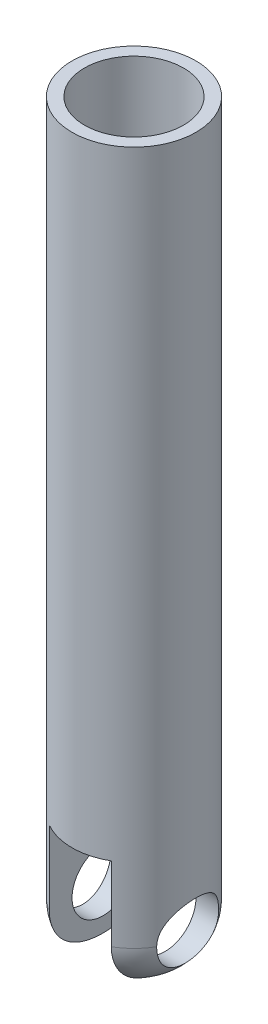
ISO-10303-21;
HEADER;
FILE_DESCRIPTION(('STEP AP214'),'2;1');
FILE_NAME('part.step','',(''),(''),'','','');
FILE_SCHEMA(('AUTOMOTIVE_DESIGN { 1 0 10303 214 1 1 1 1 }'));
ENDSEC;
DATA;
#1=APPLICATION_CONTEXT('core data for automotive mechanical design processes');
#2=APPLICATION_PROTOCOL_DEFINITION('international standard','automotive_design',2000,#1);
#3=PRODUCT_CONTEXT('',#1,'mechanical');
#4=PRODUCT('Part','Part','',(#3));
#5=PRODUCT_RELATED_PRODUCT_CATEGORY('part','',(#4));
#6=PRODUCT_DEFINITION_FORMATION('','',#4);
#7=PRODUCT_DEFINITION_CONTEXT('part definition',#1,'design');
#8=PRODUCT_DEFINITION('design','',#6,#7);
#9=PRODUCT_DEFINITION_SHAPE('','',#8);
#10=(LENGTH_UNIT() NAMED_UNIT(*) SI_UNIT(.MILLI.,.METRE.));
#11=(NAMED_UNIT(*) PLANE_ANGLE_UNIT() SI_UNIT($,.RADIAN.));
#12=(NAMED_UNIT(*) SI_UNIT($,.STERADIAN.) SOLID_ANGLE_UNIT());
#13=UNCERTAINTY_MEASURE_WITH_UNIT(LENGTH_MEASURE(1.E-05),#10,'distance_accuracy_value','');
#14=(GEOMETRIC_REPRESENTATION_CONTEXT(3) GLOBAL_UNCERTAINTY_ASSIGNED_CONTEXT((#13)) GLOBAL_UNIT_ASSIGNED_CONTEXT((#10,
#11,#12)) REPRESENTATION_CONTEXT('',''));
#15=CARTESIAN_POINT('',(0.,0.,0.));
#16=DIRECTION('',(0.,0.,1.));
#17=DIRECTION('',(1.,0.,0.));
#18=AXIS2_PLACEMENT_3D('',#15,#16,#17);
#19=CARTESIAN_POINT('',(0.,0.,0.));
#20=DIRECTION('',(0.,1.,0.));
#21=DIRECTION('',(0.,0.,1.00000000000001));
#22=AXIS2_PLACEMENT_3D('',#19,#20,#21);
#23=PLANE('',#22);
#24=DIRECTION('',(0.,0.,-1.00000000000001));
#25=VECTOR('',#24,1.);
#26=CARTESIAN_POINT('',(2.5,0.,4.33012701892219));
#27=LINE('',#26,#25);
#28=CARTESIAN_POINT('',(2.5,0.,4.33012701892219));
#29=VERTEX_POINT('',#28);
#30=CARTESIAN_POINT('',(2.5,0.,-4.33012701892221));
#31=VERTEX_POINT('',#30);
#32=EDGE_CURVE('E185',#29,#31,#27,.T.);
#33=ORIENTED_EDGE('',*,*,#32,.F.);
#34=CARTESIAN_POINT('',(0.,0.,0.));
#35=DIRECTION('',(0.,1.,0.));
#36=DIRECTION('',(0.,0.,1.00000000000001));
#37=AXIS2_PLACEMENT_3D('',#34,#35,#36);
#38=CIRCLE('',#37,5.);
#39=CARTESIAN_POINT('',(-2.5,1.11022302462516E-13,4.3301270189222));
#40=VERTEX_POINT('',#39);
#41=EDGE_CURVE('E201',#40,#29,#38,.T.);
#42=ORIENTED_EDGE('',*,*,#41,.F.);
#43=DIRECTION('',(0.,0.,-1.00000000000001));
#44=VECTOR('',#43,1.);
#45=CARTESIAN_POINT('',(-2.5,1.11022302462516E-13,4.3301270189222));
#46=LINE('',#45,#44);
#47=CARTESIAN_POINT('',(-2.50000000000002,0.,-4.33012701892221));
#48=VERTEX_POINT('',#47);
#49=EDGE_CURVE('E188',#40,#48,#46,.T.);
#50=ORIENTED_EDGE('',*,*,#49,.T.);
#51=EDGE_CURVE('E203',#31,#48,#38,.T.);
#52=ORIENTED_EDGE('',*,*,#51,.F.);
#53=EDGE_LOOP('',(#33,#42,#50,#52));
#54=FACE_BOUND('',#53,.T.);
#55=ADVANCED_FACE('F40',(#54),#23,.F.);
#56=CARTESIAN_POINT('',(0.,50.,0.));
#57=DIRECTION('',(0.,-1.,0.));
#58=DIRECTION('',(0.,0.,-1.00000000000001));
#59=AXIS2_PLACEMENT_3D('',#56,#57,#58);
#60=CYLINDRICAL_SURFACE('',#59,5.);
#61=CARTESIAN_POINT('',(0.,50.,0.));
#62=DIRECTION('',(0.,1.,0.));
#63=DIRECTION('',(0.,0.,1.00000000000001));
#64=AXIS2_PLACEMENT_3D('',#61,#62,#63);
#65=CIRCLE('',#64,5.);
#66=CARTESIAN_POINT('',(0.,50.,5.00000000000003));
#67=VERTEX_POINT('',#66);
#68=EDGE_CURVE('E114',#67,#67,#65,.T.);
#69=ORIENTED_EDGE('',*,*,#68,.F.);
#70=EDGE_LOOP('',(#69));
#71=FACE_BOUND('',#70,.T.);
#72=CARTESIAN_POINT('',(0.,-5.99999999999991,0.));
#73=DIRECTION('',(0.,-1.,0.));
#74=DIRECTION('',(0.,0.,-1.00000000000001));
#75=AXIS2_PLACEMENT_3D('',#72,#73,#74);
#76=CIRCLE('',#75,5.);
#77=CARTESIAN_POINT('',(-2.50000000000001,-5.99999999999989,-4.33012701892228));
#78=VERTEX_POINT('',#77);
#79=CARTESIAN_POINT('',(-4.33012701892222,-5.99999999999994,-2.50000000000004));
#80=VERTEX_POINT('',#79);
#81=EDGE_CURVE('E123',#78,#80,#76,.F.);
#82=ORIENTED_EDGE('',*,*,#81,.T.);
#83=CARTESIAN_POINT('',(-4.33012701892222,-5.99999999999994,-2.50000000000004));
#84=CARTESIAN_POINT('',(-4.33010776213733,-5.9345275649683,-2.50001179836252));
#85=CARTESIAN_POINT('',(-4.33161146224049,-5.8690658302234,-2.49742842336447));
#86=CARTESIAN_POINT('',(-4.33751978184663,-5.7387141001554,-2.48716418163323));
#87=CARTESIAN_POINT('',(-4.34192261900447,-5.67382377835922,-2.47948644681233));
#88=CARTESIAN_POINT('',(-4.35345141400717,-5.54545246725568,-2.45918447990413));
#89=CARTESIAN_POINT('',(-4.36056161975424,-5.4819655320367,-2.44658885069501));
#90=CARTESIAN_POINT('',(-4.37724282284497,-5.35647238591223,-2.41661724515946));
#91=CARTESIAN_POINT('',(-4.38681410283551,-5.29446634597757,-2.39924071974563));
#92=CARTESIAN_POINT('',(-4.41871214349953,-5.11153596841092,-2.34029688750619));
#93=CARTESIAN_POINT('',(-4.44426107983366,-4.9933110727187,-2.29185258147665));
#94=CARTESIAN_POINT('',(-4.50102114369152,-4.7665830641246,-2.17826216975076));
#95=CARTESIAN_POINT('',(-4.53224102252613,-4.65809536961377,-2.11309018504658));
#96=CARTESIAN_POINT('',(-4.59992530155804,-4.4442288576121,-1.96165876169876));
#97=CARTESIAN_POINT('',(-4.63660980230514,-4.33983002110544,-1.87411057186878));
#98=CARTESIAN_POINT('',(-4.70930785657941,-4.14645728529547,-1.6831106909859));
#99=CARTESIAN_POINT('',(-4.74532122571924,-4.05748757082585,-1.57965469957762));
#100=CARTESIAN_POINT('',(-4.8155367433975,-3.89158292761551,-1.35122448738116));
#101=CARTESIAN_POINT('',(-4.84945238909959,-3.81586629001233,-1.22526897701462));
#102=CARTESIAN_POINT('',(-4.9087687174303,-3.68714814839181,-0.960393600863961));
#103=CARTESIAN_POINT('',(-4.93417470668177,-3.63413248228114,-0.821481883935671));
#104=CARTESIAN_POINT('',(-4.97201138036841,-3.5562386825913,-0.545113455243643));
#105=CARTESIAN_POINT('',(-4.98523678997635,-3.52962662574906,-0.408256720567158));
#106=CARTESIAN_POINT('',(-5.00018956643816,-3.49958475430439,-0.131428863746941));
#107=CARTESIAN_POINT('',(-5.00192370311418,-3.49614129043388,0.00854037595553994));
#108=CARTESIAN_POINT('',(-4.99407451216912,-3.51186675695553,0.274582525450751));
#109=CARTESIAN_POINT('',(-4.98546223180191,-3.52909536480546,0.40080541240588));
#110=CARTESIAN_POINT('',(-4.95935579725968,-3.58220280031547,0.648286752405024));
#111=CARTESIAN_POINT('',(-4.94186114786188,-3.61808266785043,0.769544928241841));
#112=CARTESIAN_POINT('',(-4.89928974288564,-3.70770606033222,1.00577259267234));
#113=CARTESIAN_POINT('',(-4.87411141896948,-3.76168990528739,1.12063184244927));
#114=CARTESIAN_POINT('',(-4.818441594865,-3.88565757937932,1.33994046744235));
#115=CARTESIAN_POINT('',(-4.78794811508605,-3.95564737285472,1.44438594125971));
#116=CARTESIAN_POINT('',(-4.72111214797708,-4.11723260092676,1.65042713157183));
#117=CARTESIAN_POINT('',(-4.68448924833195,-4.21024431023081,1.7508219859759));
#118=CARTESIAN_POINT('',(-4.61136315843588,-4.41146145152497,1.93525018710435));
#119=CARTESIAN_POINT('',(-4.57486010471733,-4.51968041198338,2.01926880480678));
#120=CARTESIAN_POINT('',(-4.50357913990403,-4.75669931767823,2.17381714110829));
#121=CARTESIAN_POINT('',(-4.46906219482212,-4.88637427148195,2.24313548885979));
#122=CARTESIAN_POINT('',(-4.4093499609652,-5.15755746846991,2.35836398289383));
#123=CARTESIAN_POINT('',(-4.3841323816327,-5.29903640509272,2.40433020546797));
#124=CARTESIAN_POINT('',(-4.35412015572562,-5.53477728820194,2.45809029210405));
#125=CARTESIAN_POINT('',(-4.34521143406761,-5.62678244037892,2.47373896858613));
#126=CARTESIAN_POINT('',(-4.33317629399885,-5.81249116990405,2.49472015739654));
#127=CARTESIAN_POINT('',(-4.33006008341896,-5.90619745228483,2.50003445877022));
#128=CARTESIAN_POINT('',(-4.33012701892223,-5.99999999999991,2.49999999999996));
#129=B_SPLINE_CURVE_WITH_KNOTS('',3,(#83,#84,#85,#86,#87,#88,#89,#90,#91,#92,#93,#94,#95,#96,
#97,#98,#99,#100,#101,#102,#103,#104,#105,#106,#107,#108,#109,#110,#111,#112,#113,#114,#115,
#116,#117,#118,#119,#120,#121,#122,#123,#124,#125,#126,#127,#128),.UNSPECIFIED.,.F.,.F.,(4,2,2,
2,2,2,2,2,2,2,2,2,2,2,2,2,2,2,2,2,2,2,4),(0.,0.196331555537095,0.39254252198829,
0.587628912502713,0.782737718108223,1.17178476798555,1.56143737011987,1.98295902719591,
2.40459483519139,2.85470113901085,3.30452623161871,3.72233927392686,4.13990614928141,
4.52116163006035,4.90243836948527,5.28899106640394,5.67568804085463,6.09890794628561,
6.52250676283658,6.9732847261477,7.4229750420921,7.70351603915598,7.98455095154992),.UNSPECIFIED.);
#130=CARTESIAN_POINT('',(-4.33012701892223,-5.99999999999991,2.49999999999996));
#131=VERTEX_POINT('',#130);
#132=EDGE_CURVE('E60',#80,#131,#129,.T.);
#133=ORIENTED_EDGE('',*,*,#132,.T.);
#134=CARTESIAN_POINT('',(-2.50000000000001,-5.99999999999987,4.33012701892217));
#135=VERTEX_POINT('',#134);
#136=EDGE_CURVE('E113',#131,#135,#76,.F.);
#137=ORIENTED_EDGE('',*,*,#136,.T.);
#138=DIRECTION('',(0.,1.,0.));
#139=VECTOR('',#138,1.);
#140=CARTESIAN_POINT('',(-2.5,-9.99999999999995,4.33012701892218));
#141=LINE('',#140,#139);
#142=EDGE_CURVE('E192',#135,#40,#141,.T.);
#143=ORIENTED_EDGE('',*,*,#142,.T.);
#144=ORIENTED_EDGE('',*,*,#41,.T.);
#145=DIRECTION('',(0.,1.,0.));
#146=VECTOR('',#145,1.);
#147=CARTESIAN_POINT('',(2.50000000000001,-9.99999999999995,4.33012701892218));
#148=LINE('',#147,#146);
#149=CARTESIAN_POINT('',(2.5,-5.99999999999999,4.33012701892219));
#150=VERTEX_POINT('',#149);
#151=EDGE_CURVE('E183',#150,#29,#148,.T.);
#152=ORIENTED_EDGE('',*,*,#151,.F.);
#153=CARTESIAN_POINT('',(0.,-5.99999999999991,0.));
#154=DIRECTION('',(0.,-1.,0.));
#155=DIRECTION('',(0.,0.,-1.00000000000001));
#156=AXIS2_PLACEMENT_3D('',#153,#154,#155);
#157=CIRCLE('',#156,5.);
#158=CARTESIAN_POINT('',(4.3301270189222,-5.99999999999996,2.49999999999998));
#159=VERTEX_POINT('',#158);
#160=EDGE_CURVE('E104',#150,#159,#157,.F.);
#161=ORIENTED_EDGE('',*,*,#160,.T.);
#162=CARTESIAN_POINT('',(4.3301270189222,-5.99999999999996,2.49999999999998));
#163=CARTESIAN_POINT('',(4.33010776213735,-5.93452756496831,2.5000117983625));
#164=CARTESIAN_POINT('',(4.33161146224053,-5.86906583022341,2.49742842336447));
#165=CARTESIAN_POINT('',(4.33751978184668,-5.73871410015541,2.48716418163324));
#166=CARTESIAN_POINT('',(4.34192261900451,-5.67382377835923,2.47948644681233));
#167=CARTESIAN_POINT('',(4.35345141400722,-5.5454524672557,2.45918447990413));
#168=CARTESIAN_POINT('',(4.3605616197543,-5.48196553203671,2.44658885069503));
#169=CARTESIAN_POINT('',(4.37724282284501,-5.35647238591225,2.41661724515946));
#170=CARTESIAN_POINT('',(4.38681410283551,-5.29446634597759,2.39924071974561));
#171=CARTESIAN_POINT('',(4.41871214349951,-5.11153596841092,2.34029688750615));
#172=CARTESIAN_POINT('',(4.44426107983374,-4.99331107271869,2.29185258147664));
#173=CARTESIAN_POINT('',(4.50102114369159,-4.76658306412457,2.17826216975074));
#174=CARTESIAN_POINT('',(4.5322410225261,-4.65809536961372,2.11309018504651));
#175=CARTESIAN_POINT('',(4.59992530155802,-4.44422885761205,1.96165876169866));
#176=CARTESIAN_POINT('',(4.63660980230523,-4.3398300211054,1.87411057186873));
#177=CARTESIAN_POINT('',(4.70930785657952,-4.14645728529545,1.68311069098588));
#178=CARTESIAN_POINT('',(4.74532122571924,-4.05748757082584,1.5796546995776));
#179=CARTESIAN_POINT('',(4.81553674339751,-3.89158292761549,1.35122448738115));
#180=CARTESIAN_POINT('',(4.84945238909972,-3.81586629001231,1.22526897701464));
#181=CARTESIAN_POINT('',(4.9087687174304,-3.68714814839188,0.960393600863965));
#182=CARTESIAN_POINT('',(4.93417470668172,-3.6341324822813,0.821481883935618));
#183=CARTESIAN_POINT('',(4.97201138036841,-3.55623868259143,0.54511345524356));
#184=CARTESIAN_POINT('',(4.98523678997652,-3.52962662574909,0.408256720567096));
#185=CARTESIAN_POINT('',(5.00018956643831,-3.49958475430437,0.131428863746885));
#186=CARTESIAN_POINT('',(5.00192370311415,-3.49614129043389,-0.00854037595561104));
#187=CARTESIAN_POINT('',(4.99407451216911,-3.51186675695558,-0.27458252545083));
#188=CARTESIAN_POINT('',(4.98546223180209,-3.5290953648055,-0.400805412405951));
#189=CARTESIAN_POINT('',(4.95935579725987,-3.58220280031548,-0.648286752405063));
#190=CARTESIAN_POINT('',(4.94186114786188,-3.61808266785041,-0.769544928241854));
#191=CARTESIAN_POINT('',(4.89928974288564,-3.70770606033223,-1.00577259267234));
#192=CARTESIAN_POINT('',(4.87411141896968,-3.76168990528745,-1.12063184244929));
#193=CARTESIAN_POINT('',(4.81844159486522,-3.88565757937933,-1.33994046744241));
#194=CARTESIAN_POINT('',(4.78794811508608,-3.95564737285461,-1.44438594125981));
#195=CARTESIAN_POINT('',(4.72111214797711,-4.11723260092665,-1.65042713157191));
#196=CARTESIAN_POINT('',(4.6844892483322,-4.21024431023084,-1.75082198597591));
#197=CARTESIAN_POINT('',(4.61136315843613,-4.41146145152501,-1.93525018710436));
#198=CARTESIAN_POINT('',(4.57486010471734,-4.51968041198328,-2.01926880480686));
#199=CARTESIAN_POINT('',(4.50357913990405,-4.7566993176781,-2.17381714110837));
#200=CARTESIAN_POINT('',(4.46906219482243,-4.88637427148194,-2.24313548885981));
#201=CARTESIAN_POINT('',(4.40934996096547,-5.15755746846995,-2.35836398289381));
#202=CARTESIAN_POINT('',(4.38413238163264,-5.29903640509271,-2.40433020546798));
#203=CARTESIAN_POINT('',(4.35412015572566,-5.53477728820194,-2.45809029210406));
#204=CARTESIAN_POINT('',(4.34521143406783,-5.62678244037894,-2.47373896858613));
#205=CARTESIAN_POINT('',(4.33317629399924,-5.81249116990412,-2.49472015739654));
#206=CARTESIAN_POINT('',(4.33006008341932,-5.90619745228491,-2.50003445877025));
#207=CARTESIAN_POINT('',(4.33012701892223,-5.99999999999996,-2.50000000000006));
#208=B_SPLINE_CURVE_WITH_KNOTS('',3,(#162,#163,#164,#165,#166,#167,#168,#169,#170,#171,#172,
#173,#174,#175,#176,#177,#178,#179,#180,#181,#182,#183,#184,#185,#186,#187,#188,#189,#190,#191,
#192,#193,#194,#195,#196,#197,#198,#199,#200,#201,#202,#203,#204,#205,#206,#207),.UNSPECIFIED.,
.F.,.F.,(4,2,2,2,2,2,2,2,2,2,2,2,2,2,2,2,2,2,2,2,2,2,4),(0.,0.196331555537097,0.392542521988294,
0.587628912502711,0.782737718108215,1.17178476798559,1.56143737011997,1.98295902719597,
2.4045948351914,2.85470113901084,3.30452623161871,3.72233927392691,4.13990614928147,
4.52116163006037,4.90243836948525,5.28899106640393,5.67568804085462,6.09890794628559,
6.52250676283654,6.97328472614768,7.42297504209211,7.70351603915602,7.98455095154997),.UNSPECIFIED.);
#209=CARTESIAN_POINT('',(4.33012701892223,-5.99999999999996,-2.50000000000006));
#210=VERTEX_POINT('',#209);
#211=EDGE_CURVE('E66',#159,#210,#208,.T.);
#212=ORIENTED_EDGE('',*,*,#211,.T.);
#213=CARTESIAN_POINT('',(2.50000000000003,-5.99999999999994,-4.33012701892225));
#214=VERTEX_POINT('',#213);
#215=EDGE_CURVE('E100',#210,#214,#157,.F.);
#216=ORIENTED_EDGE('',*,*,#215,.T.);
#217=DIRECTION('',(0.,1.,0.));
#218=VECTOR('',#217,1.);
#219=CARTESIAN_POINT('',(2.50000000000005,-9.99999999999989,-4.33012701892229));
#220=LINE('',#219,#218);
#221=EDGE_CURVE('E181',#214,#31,#220,.T.);
#222=ORIENTED_EDGE('',*,*,#221,.T.);
#223=ORIENTED_EDGE('',*,*,#51,.T.);
#224=DIRECTION('',(0.,1.,0.));
#225=VECTOR('',#224,1.);
#226=CARTESIAN_POINT('',(-2.5,-9.99999999999999,-4.33012701892221));
#227=LINE('',#226,#225);
#228=EDGE_CURVE('E191',#78,#48,#227,.T.);
#229=ORIENTED_EDGE('',*,*,#228,.F.);
#230=EDGE_LOOP('',(#82,#133,#137,#143,#144,#152,#161,#212,#216,#222,#223,#229));
#231=FACE_BOUND('',#230,.T.);
#232=ADVANCED_FACE('F98',(#71,#231),#60,.T.);
#233=CARTESIAN_POINT('',(0.,50.,0.));
#234=DIRECTION('',(0.,1.,0.));
#235=DIRECTION('',(0.,0.,1.00000000000001));
#236=AXIS2_PLACEMENT_3D('',#233,#234,#235);
#237=PLANE('',#236);
#238=CARTESIAN_POINT('',(0.,50.,0.));
#239=DIRECTION('',(0.,1.,0.));
#240=DIRECTION('',(0.,0.,1.00000000000001));
#241=AXIS2_PLACEMENT_3D('',#238,#239,#240);
#242=CIRCLE('',#241,4.);
#243=CARTESIAN_POINT('',(-1.10980669099092E-13,50.,-3.99999999999992));
#244=VERTEX_POINT('',#243);
#245=EDGE_CURVE('E198',#244,#244,#242,.F.);
#246=ORIENTED_EDGE('',*,*,#245,.T.);
#247=EDGE_LOOP('',(#246));
#248=FACE_BOUND('',#247,.T.);
#249=ORIENTED_EDGE('',*,*,#68,.T.);
#250=EDGE_LOOP('',(#249));
#251=FACE_BOUND('',#250,.T.);
#252=ADVANCED_FACE('F147',(#248,#251),#237,.T.);
#253=CARTESIAN_POINT('',(-1.196959198424E-13,54.,1.11022302462516E-13));
#254=DIRECTION('',(0.,-1.,0.));
#255=DIRECTION('',(0.,0.,-1.00000000000001));
#256=AXIS2_PLACEMENT_3D('',#253,#254,#255);
#257=CYLINDRICAL_SURFACE('',#256,4.);
#258=CARTESIAN_POINT('',(0.,4.00000000000002,0.));
#259=DIRECTION('',(0.,1.,0.));
#260=DIRECTION('',(0.,0.,1.00000000000001));
#261=AXIS2_PLACEMENT_3D('',#258,#259,#260);
#262=CIRCLE('',#261,4.);
#263=CARTESIAN_POINT('',(0.,4.00000000000004,-4.00000000000001));
#264=VERTEX_POINT('',#263);
#265=EDGE_CURVE('E194',#264,#264,#262,.T.);
#266=CARTESIAN_POINT('',(-1.10980669099092E-13,50.,-3.99999999999992));
#267=CARTESIAN_POINT('',(-1.10229244713415E-13,49.5208333333334,-3.99999999999992));
#268=CARTESIAN_POINT('',(-1.09477820327738E-13,49.0416666666667,-3.99999999999993));
#269=CARTESIAN_POINT('',(-1.07974971556383E-13,48.0833333333334,-3.99999999999993));
#270=CARTESIAN_POINT('',(-1.07223547170706E-13,47.6041666666667,-3.99999999999993));
#271=CARTESIAN_POINT('',(-1.05720698399351E-13,46.6458333333334,-3.99999999999993));
#272=CARTESIAN_POINT('',(-1.04969274013674E-13,46.1666666666667,-3.99999999999993));
#273=CARTESIAN_POINT('',(-1.03466425242319E-13,45.2083333333334,-3.99999999999993));
#274=CARTESIAN_POINT('',(-1.02715000856642E-13,44.7291666666667,-3.99999999999993));
#275=CARTESIAN_POINT('',(-1.01212152085287E-13,43.7708333333334,-3.99999999999994));
#276=CARTESIAN_POINT('',(-1.0046072769961E-13,43.2916666666667,-3.99999999999994));
#277=CARTESIAN_POINT('',(0.,42.3333333333334,-3.99999999999994));
#278=CARTESIAN_POINT('',(0.,41.8541666666667,-3.99999999999994));
#279=CARTESIAN_POINT('',(0.,40.8958333333334,-3.99999999999994));
#280=CARTESIAN_POINT('',(0.,40.4166666666667,-3.99999999999994));
#281=CARTESIAN_POINT('',(0.,39.4583333333334,-3.99999999999994));
#282=CARTESIAN_POINT('',(0.,38.9791666666667,-3.99999999999994));
#283=CARTESIAN_POINT('',(0.,38.0208333333334,-3.99999999999995));
#284=CARTESIAN_POINT('',(0.,37.5416666666667,-3.99999999999995));
#285=CARTESIAN_POINT('',(0.,36.5833333333334,-3.99999999999995));
#286=CARTESIAN_POINT('',(0.,36.1041666666667,-3.99999999999995));
#287=CARTESIAN_POINT('',(0.,35.1458333333334,-3.99999999999995));
#288=CARTESIAN_POINT('',(0.,34.6666666666667,-3.99999999999995));
#289=CARTESIAN_POINT('',(0.,33.7083333333334,-3.99999999999996));
#290=CARTESIAN_POINT('',(0.,33.2291666666667,-3.99999999999996));
#291=CARTESIAN_POINT('',(0.,32.2708333333334,-3.99999999999996));
#292=CARTESIAN_POINT('',(0.,31.7916666666667,-3.99999999999996));
#293=CARTESIAN_POINT('',(0.,30.8333333333334,-3.99999999999996));
#294=CARTESIAN_POINT('',(0.,30.3541666666667,-3.99999999999996));
#295=CARTESIAN_POINT('',(0.,29.3958333333334,-3.99999999999996));
#296=CARTESIAN_POINT('',(0.,28.9166666666667,-3.99999999999996));
#297=CARTESIAN_POINT('',(0.,27.9583333333334,-3.99999999999997));
#298=CARTESIAN_POINT('',(0.,27.4791666666667,-3.99999999999997));
#299=CARTESIAN_POINT('',(0.,26.5208333333334,-3.99999999999997));
#300=CARTESIAN_POINT('',(0.,26.0416666666667,-3.99999999999997));
#301=CARTESIAN_POINT('',(0.,25.0833333333334,-3.99999999999997));
#302=CARTESIAN_POINT('',(0.,24.6041666666667,-3.99999999999997));
#303=CARTESIAN_POINT('',(0.,23.6458333333334,-3.99999999999997));
#304=CARTESIAN_POINT('',(0.,23.1666666666667,-3.99999999999998));
#305=CARTESIAN_POINT('',(0.,22.2083333333334,-3.99999999999998));
#306=CARTESIAN_POINT('',(0.,21.7291666666667,-3.99999999999998));
#307=CARTESIAN_POINT('',(0.,20.7708333333334,-3.99999999999998));
#308=CARTESIAN_POINT('',(0.,20.2916666666667,-3.99999999999998));
#309=CARTESIAN_POINT('',(0.,19.3333333333334,-3.99999999999998));
#310=CARTESIAN_POINT('',(0.,18.8541666666667,-3.99999999999998));
#311=CARTESIAN_POINT('',(0.,17.8958333333334,-3.99999999999999));
#312=CARTESIAN_POINT('',(0.,17.4166666666667,-3.99999999999999));
#313=CARTESIAN_POINT('',(0.,16.4583333333334,-3.99999999999999));
#314=CARTESIAN_POINT('',(0.,15.9791666666667,-3.99999999999999));
#315=CARTESIAN_POINT('',(0.,15.0208333333334,-3.99999999999999));
#316=CARTESIAN_POINT('',(0.,14.5416666666667,-3.99999999999999));
#317=CARTESIAN_POINT('',(0.,13.5833333333334,-3.99999999999999));
#318=CARTESIAN_POINT('',(0.,13.1041666666667,-3.99999999999999));
#319=CARTESIAN_POINT('',(0.,12.1458333333334,-4.));
#320=CARTESIAN_POINT('',(0.,11.6666666666667,-4.));
#321=CARTESIAN_POINT('',(0.,10.7083333333334,-4.));
#322=CARTESIAN_POINT('',(0.,10.2291666666667,-4.));
#323=CARTESIAN_POINT('',(0.,9.27083333333338,-4.));
#324=CARTESIAN_POINT('',(0.,8.79166666666671,-4.));
#325=CARTESIAN_POINT('',(0.,7.83333333333337,-4.));
#326=CARTESIAN_POINT('',(0.,7.35416666666671,-4.00000000000001));
#327=CARTESIAN_POINT('',(0.,6.39583333333337,-4.00000000000001));
#328=CARTESIAN_POINT('',(0.,5.91666666666671,-4.00000000000001));
#329=CARTESIAN_POINT('',(0.,4.95833333333337,-4.00000000000001));
#330=CARTESIAN_POINT('',(0.,4.47916666666671,-4.00000000000001));
#331=CARTESIAN_POINT('',(0.,4.00000000000004,-4.00000000000001));
#332=B_SPLINE_CURVE_WITH_KNOTS('',3,(#266,#267,#268,#269,#270,#271,#272,#273,#274,#275,#276,
#277,#278,#279,#280,#281,#282,#283,#284,#285,#286,#287,#288,#289,#290,#291,#292,#293,#294,#295,
#296,#297,#298,#299,#300,#301,#302,#303,#304,#305,#306,#307,#308,#309,#310,#311,#312,#313,#314,
#315,#316,#317,#318,#319,#320,#321,#322,#323,#324,#325,#326,#327,#328,#329,#330,#331),
.UNSPECIFIED.,.F.,.F.,(4,2,2,2,2,2,2,2,2,2,2,2,2,2,2,2,2,2,2,2,2,2,2,2,2,2,2,2,2,2,2,2,4),(0.,
1.43749999999999,2.875,4.3125,5.75,7.18749999999999,8.62499999999999,10.0625,11.5,12.9375,
14.375,15.8125,17.25,18.6875,20.125,21.5625,23.,24.4375,25.875,27.3125,28.75,30.1875,31.625,
33.0625,34.5,35.9375,37.375,38.8125,40.25,41.6875,43.125,44.5625,46.),.UNSPECIFIED.);
#333=EDGE_CURVE('BSEAM143',#244,#264,#332,.T.);
#334=ORIENTED_EDGE('',*,*,#245,.F.);
#335=ORIENTED_EDGE('',*,*,#265,.F.);
#336=ORIENTED_EDGE('',*,*,#333,.T.);
#337=ORIENTED_EDGE('',*,*,#333,.F.);
#338=EDGE_LOOP('',(#334,#336,#335,#337));
#339=FACE_BOUND('',#338,.T.);
#340=ADVANCED_FACE('F143',(#339),#257,.F.);
#341=CARTESIAN_POINT('',(0.,4.00000000000002,0.));
#342=DIRECTION('',(0.,1.,0.));
#343=DIRECTION('',(0.,0.,1.00000000000001));
#344=AXIS2_PLACEMENT_3D('',#341,#342,#343);
#345=PLANE('',#344);
#346=ORIENTED_EDGE('',*,*,#265,.T.);
#347=EDGE_LOOP('',(#346));
#348=FACE_BOUND('',#347,.T.);
#349=ADVANCED_FACE('F139',(#348),#345,.T.);
#350=CARTESIAN_POINT('',(-2.5,-9.99999999999995,4.33012701892218));
#351=DIRECTION('',(1.00000000000001,0.,0.));
#352=DIRECTION('',(0.,0.,-1.00000000000001));
#353=AXIS2_PLACEMENT_3D('',#350,#351,#352);
#354=PLANE('',#353);
#355=CARTESIAN_POINT('',(-2.5,-6.,0.));
#356=DIRECTION('',(1.00000000000001,0.,0.));
#357=DIRECTION('',(0.,0.,-1.00000000000001));
#358=AXIS2_PLACEMENT_3D('',#355,#356,#357);
#359=CIRCLE('',#358,2.5);
#360=CARTESIAN_POINT('',(-2.5,-6.,-2.50000000000002));
#361=VERTEX_POINT('',#360);
#362=EDGE_CURVE('E178',#361,#361,#359,.T.);
#363=ORIENTED_EDGE('',*,*,#362,.F.);
#364=EDGE_LOOP('',(#363));
#365=FACE_BOUND('',#364,.T.);
#366=ORIENTED_EDGE('',*,*,#142,.F.);
#367=CARTESIAN_POINT('',(-2.50000000000001,-5.99999999999987,4.33012701892217));
#368=CARTESIAN_POINT('',(-2.5,-6.09847248638812,4.33013838562468));
#369=CARTESIAN_POINT('',(-2.49999999999999,-6.19693960026872,4.32592829535486));
#370=CARTESIAN_POINT('',(-2.49999999999999,-6.393149614458,4.30915275131864));
#371=CARTESIAN_POINT('',(-2.49999999999999,-6.4908925885988,4.29658816155604));
#372=CARTESIAN_POINT('',(-2.49999999999999,-6.68479454510381,4.2632198681407));
#373=CARTESIAN_POINT('',(-2.49999999999999,-6.78095596361571,4.2424303785419));
#374=CARTESIAN_POINT('',(-2.49999999999999,-6.97115186951441,4.19280623979673));
#375=CARTESIAN_POINT('',(-2.5,-7.06518636339044,4.16397161519961));
#376=CARTESIAN_POINT('',(-2.5,-7.34314274323298,4.06569976622368));
#377=CARTESIAN_POINT('',(-2.49999999999999,-7.52305094802332,3.98447139762835));
#378=CARTESIAN_POINT('',(-2.5,-7.86678105496723,3.79333596620052));
#379=CARTESIAN_POINT('',(-2.5,-8.03060161129779,3.68342650684025));
#380=CARTESIAN_POINT('',(-2.5,-8.34001282195989,3.43696973685176));
#381=CARTESIAN_POINT('',(-2.5,-8.48536284994849,3.30012046625242));
#382=CARTESIAN_POINT('',(-2.49999999999999,-8.7522924604631,3.005053401047));
#383=CARTESIAN_POINT('',(-2.49999999999999,-8.87387437109818,2.84683770187179));
#384=CARTESIAN_POINT('',(-2.49999999999999,-9.09712457344664,2.50518315051492));
#385=CARTESIAN_POINT('',(-2.5,-9.19743772317642,2.3208629818915));
#386=CARTESIAN_POINT('',(-2.5,-9.36961571932303,1.93929602061299));
#387=CARTESIAN_POINT('',(-2.5,-9.44145199000553,1.74203647376737));
#388=CARTESIAN_POINT('',(-2.5,-9.54262988433968,1.39366998180663));
#389=CARTESIAN_POINT('',(-2.5,-9.57819665827824,1.24430581532747));
#390=CARTESIAN_POINT('',(-2.5,-9.63608158686922,0.942957731351448));
#391=CARTESIAN_POINT('',(-2.5,-9.65839187032792,0.790972312451479));
#392=CARTESIAN_POINT('',(-2.5,-9.6908904991842,0.48558495693648));
#393=CARTESIAN_POINT('',(-2.5,-9.70106619894133,0.33218171020189));
#394=CARTESIAN_POINT('',(-2.5,-9.70996192089076,0.0251164991781943));
#395=CARTESIAN_POINT('',(-2.5,-9.70868627966177,-0.128545345141884));
#396=CARTESIAN_POINT('',(-2.5,-9.69305489180686,-0.469270301362988));
#397=CARTESIAN_POINT('',(-2.49999999999999,-9.67587209005823,-0.656213801509328));
#398=CARTESIAN_POINT('',(-2.5,-9.62268946448822,-1.02731854426741));
#399=CARTESIAN_POINT('',(-2.5,-9.58670891471523,-1.2114824382827));
#400=CARTESIAN_POINT('',(-2.5,-9.50872176441404,-1.51615760016887));
#401=CARTESIAN_POINT('',(-2.5,-9.47235858747879,-1.63812195025078));
#402=CARTESIAN_POINT('',(-2.49999999999999,-9.38944003726109,-1.87858238138482));
#403=CARTESIAN_POINT('',(-2.5,-9.34288366302906,-1.99707812053054));
#404=CARTESIAN_POINT('',(-2.49999999999999,-9.23925275091919,-2.22945704816589));
#405=CARTESIAN_POINT('',(-2.49999999999999,-9.18217370153479,-2.34333823256169));
#406=CARTESIAN_POINT('',(-2.5,-9.05746967569143,-2.56518220488551));
#407=CARTESIAN_POINT('',(-2.50000000000002,-8.98984568338446,-2.67314554385226));
#408=CARTESIAN_POINT('',(-2.50000000000001,-8.84802671754944,-2.87651160208627));
#409=CARTESIAN_POINT('',(-2.5,-8.77434901818334,-2.9722747955202));
#410=CARTESIAN_POINT('',(-2.49999999999999,-8.61811826601497,-3.15626451999449));
#411=CARTESIAN_POINT('',(-2.49999999999999,-8.53556611510986,-3.24449181526449));
#412=CARTESIAN_POINT('',(-2.49999999999999,-8.36220205847163,-3.41237235417328));
#413=CARTESIAN_POINT('',(-2.49999999999999,-8.27139264749606,-3.49202817172797));
#414=CARTESIAN_POINT('',(-2.49999999999999,-8.08226087426148,-3.64184445799708));
#415=CARTESIAN_POINT('',(-2.5,-7.98393973872419,-3.7120064719578));
#416=CARTESIAN_POINT('',(-2.5,-7.79475399686791,-3.83300536572604));
#417=CARTESIAN_POINT('',(-2.49999999999999,-7.70473734091557,-3.88517293586636));
#418=CARTESIAN_POINT('',(-2.49999999999999,-7.52045861838397,-3.98136399855772));
#419=CARTESIAN_POINT('',(-2.49999999999999,-7.4261970255872,-4.02538839719042));
#420=CARTESIAN_POINT('',(-2.49999999999999,-7.23422825328519,-4.10485401737073));
#421=CARTESIAN_POINT('',(-2.49999999999999,-7.13652450956191,-4.14030353458748));
#422=CARTESIAN_POINT('',(-2.5,-6.93837888778507,-4.20234194818037));
#423=CARTESIAN_POINT('',(-2.50000000000001,-6.8379378217807,-4.22893344206445));
#424=CARTESIAN_POINT('',(-2.50000000000001,-6.61555740500938,-4.27725528776866));
#425=CARTESIAN_POINT('',(-2.5,-6.49319676082643,-4.29706875192575));
#426=CARTESIAN_POINT('',(-2.49999999999998,-6.24722074512801,-4.32351315732626));
#427=CARTESIAN_POINT('',(-2.49999999999998,-6.12360719981729,-4.33016110437708));
#428=CARTESIAN_POINT('',(-2.5,-5.99999999999993,-4.33012701892225));
#429=B_SPLINE_CURVE_WITH_KNOTS('',3,(#367,#368,#369,#370,#371,#372,#373,#374,#375,#376,#377,
#378,#379,#380,#381,#382,#383,#384,#385,#386,#387,#388,#389,#390,#391,#392,#393,#394,#395,#396,
#397,#398,#399,#400,#401,#402,#403,#404,#405,#406,#407,#408,#409,#410,#411,#412,#413,#414,#415,
#416,#417,#418,#419,#420,#421,#422,#423,#424,#425,#426,#427,#428),.UNSPECIFIED.,.F.,.F.,(4,2,2,
2,2,2,2,2,2,2,2,2,2,2,2,2,2,2,2,2,2,2,2,2,2,2,2,2,2,2,4),(0.,0.295318039242056,0.59060554209663,
0.885384950543504,1.18016345949889,1.76931937525025,2.35852453532373,2.95475433151329,
3.55092569714919,4.17793073497406,4.80556337133136,5.26558535763967,5.72588021505203,
6.18665433495107,6.64725396882973,7.20959664182425,7.77136385175755,8.15277313200856,
8.53421988262415,8.91583055721338,9.29740563764359,9.65934333495007,10.0212442837844,
10.3830362528717,10.744769264356,11.0565000671158,11.3681961630422,11.6795894952397,
11.9908914345711,12.362031056042,12.7326909655323),.UNSPECIFIED.);
#430=EDGE_CURVE('E111',#135,#78,#429,.T.);
#431=ORIENTED_EDGE('',*,*,#430,.T.);
#432=ORIENTED_EDGE('',*,*,#228,.T.);
#433=ORIENTED_EDGE('',*,*,#49,.F.);
#434=EDGE_LOOP('',(#366,#431,#432,#433));
#435=FACE_BOUND('',#434,.T.);
#436=ADVANCED_FACE('F133',(#365,#435),#354,.T.);
#437=CARTESIAN_POINT('',(2.50000000000001,-9.99999999999995,4.33012701892218));
#438=DIRECTION('',(1.00000000000001,0.,0.));
#439=DIRECTION('',(0.,0.,-1.00000000000001));
#440=AXIS2_PLACEMENT_3D('',#437,#438,#439);
#441=PLANE('',#440);
#442=CARTESIAN_POINT('',(2.50000000000002,-6.,0.));
#443=DIRECTION('',(1.00000000000001,0.,0.));
#444=DIRECTION('',(0.,0.,-1.00000000000001));
#445=AXIS2_PLACEMENT_3D('',#442,#443,#444);
#446=CIRCLE('',#445,2.5);
#447=CARTESIAN_POINT('',(2.50000000000002,-6.,-2.50000000000003));
#448=VERTEX_POINT('',#447);
#449=EDGE_CURVE('E171',#448,#448,#446,.T.);
#450=ORIENTED_EDGE('',*,*,#449,.T.);
#451=EDGE_LOOP('',(#450));
#452=FACE_BOUND('',#451,.T.);
#453=ORIENTED_EDGE('',*,*,#221,.F.);
#454=CARTESIAN_POINT('',(2.50000000000003,-5.99999999999994,-4.33012701892225));
#455=CARTESIAN_POINT('',(2.50000000000003,-6.09846309753507,-4.33013837973417));
#456=CARTESIAN_POINT('',(2.50000000000002,-6.19692081504883,-4.32592909568686));
#457=CARTESIAN_POINT('',(2.50000000000002,-6.39311227959118,-4.30915674717145));
#458=CARTESIAN_POINT('',(2.50000000000002,-6.49084610015328,-4.29659454329528));
#459=CARTESIAN_POINT('',(2.50000000000002,-6.68474861539586,-4.26322938717685));
#460=CARTESIAN_POINT('',(2.50000000000002,-6.78091947686726,-4.24243907879082));
#461=CARTESIAN_POINT('',(2.50000000000002,-6.97113392407186,-4.19281174248305));
#462=CARTESIAN_POINT('',(2.50000000000003,-7.06517751619874,-4.1639747387498));
#463=CARTESIAN_POINT('',(2.50000000000003,-7.343162961953,-4.06569262663514));
#464=CARTESIAN_POINT('',(2.50000000000002,-7.52309023597798,-3.9844537141284));
#465=CARTESIAN_POINT('',(2.50000000000002,-7.86681696258362,-3.79331182876942));
#466=CARTESIAN_POINT('',(2.50000000000002,-8.03061858064883,-3.68341271189566));
#467=CARTESIAN_POINT('',(2.50000000000002,-8.33996067150893,-3.43701155801829));
#468=CARTESIAN_POINT('',(2.50000000000002,-8.48526518203645,-3.30021343704806));
#469=CARTESIAN_POINT('',(2.50000000000001,-8.75221133229639,-3.00515807365649));
#470=CARTESIAN_POINT('',(2.50000000000001,-8.87383944077008,-2.84688864736735));
#471=CARTESIAN_POINT('',(2.50000000000001,-9.0972542869465,-2.50498728405901));
#472=CARTESIAN_POINT('',(2.50000000000002,-9.19766171166851,-2.32045940191633));
#473=CARTESIAN_POINT('',(2.50000000000001,-9.36978733226292,-1.93882269960844));
#474=CARTESIAN_POINT('',(2.49999999999998,-9.44154238925445,-1.74173042469909));
#475=CARTESIAN_POINT('',(2.50000000000002,-9.51410831083563,-1.49187158636323));
#476=CARTESIAN_POINT('',(2.50000000000003,-9.52757301805611,-1.44251468645959));
#477=CARTESIAN_POINT('',(2.50000000000005,-9.57956217886248,-1.23939061728393));
#478=CARTESIAN_POINT('',(2.50000000000003,-9.61138901425385,-1.08384197563962));
#479=CARTESIAN_POINT('',(2.50000000000001,-9.66133979949265,-0.770485841252909));
#480=CARTESIAN_POINT('',(2.50000000000002,-9.67944862026568,-0.612676049568433));
#481=CARTESIAN_POINT('',(2.50000000000002,-9.70313319170797,-0.295444437116401));
#482=CARTESIAN_POINT('',(2.50000000000001,-9.70865580733448,-0.136018625632103));
#483=CARTESIAN_POINT('',(2.50000000000002,-9.70745468739057,0.182657927232627));
#484=CARTESIAN_POINT('',(2.50000000000003,-9.70073589852285,0.341908713320835));
#485=CARTESIAN_POINT('',(2.50000000000004,-9.66529781209021,0.77118285663646));
#486=CARTESIAN_POINT('',(2.50000000000002,-9.62444107590017,1.04045205817101));
#487=CARTESIAN_POINT('',(2.50000000000001,-9.53092916002253,1.43606408473786));
#488=CARTESIAN_POINT('',(2.50000000000001,-9.49446798856516,1.56635899682195));
#489=CARTESIAN_POINT('',(2.50000000000002,-9.41011259029169,1.82323165283056));
#490=CARTESIAN_POINT('',(2.50000000000002,-9.36222097255414,1.94981023763882));
#491=CARTESIAN_POINT('',(2.50000000000002,-9.26496252523103,2.17399141835403));
#492=CARTESIAN_POINT('',(2.50000000000002,-9.21764756904762,2.27248809044953));
#493=CARTESIAN_POINT('',(2.50000000000002,-9.11523293326624,2.46538862915547));
#494=CARTESIAN_POINT('',(2.50000000000002,-9.06013186602737,2.55979176228748));
#495=CARTESIAN_POINT('',(2.50000000000002,-8.94221986621277,2.74370830261743));
#496=CARTESIAN_POINT('',(2.50000000000002,-8.87940625266127,2.83321999377664));
#497=CARTESIAN_POINT('',(2.50000000000001,-8.74629140211657,3.0065476910914));
#498=CARTESIAN_POINT('',(2.50000000000001,-8.67598770445209,3.09036181055388));
#499=CARTESIAN_POINT('',(2.50000000000001,-8.52802531970784,3.25175172708573));
#500=CARTESIAN_POINT('',(2.50000000000001,-8.45034279645959,3.32930569906156));
#501=CARTESIAN_POINT('',(2.50000000000002,-8.2882821823554,3.47714213684923));
#502=CARTESIAN_POINT('',(2.50000000000002,-8.20390160379809,3.54742187842599));
#503=CARTESIAN_POINT('',(2.50000000000002,-8.02910267366782,3.67996137148267));
#504=CARTESIAN_POINT('',(2.50000000000002,-7.93868640799293,3.74222387210874));
#505=CARTESIAN_POINT('',(2.50000000000002,-7.75244355471828,3.85816140900876));
#506=CARTESIAN_POINT('',(2.50000000000002,-7.65661457914451,3.91183261431184));
#507=CARTESIAN_POINT('',(2.50000000000002,-7.46757798967848,4.00640384811626));
#508=CARTESIAN_POINT('',(2.50000000000002,-7.37469399253916,4.04795201312878));
#509=CARTESIAN_POINT('',(2.50000000000002,-7.18566652312359,4.12281467575593));
#510=CARTESIAN_POINT('',(2.50000000000002,-7.08952323429902,4.15612963591056));
#511=CARTESIAN_POINT('',(2.50000000000002,-6.89484042951271,4.21418992063268));
#512=CARTESIAN_POINT('',(2.50000000000002,-6.79630467333227,4.23894786404934));
#513=CARTESIAN_POINT('',(2.50000000000001,-6.59748418498991,4.27973444804126));
#514=CARTESIAN_POINT('',(2.5,-6.49720036796447,4.29576752249426));
#515=CARTESIAN_POINT('',(2.50000000000001,-6.33058406724042,4.31495534686956));
#516=CARTESIAN_POINT('',(2.50000000000002,-6.26453326636495,4.32064774316618));
#517=CARTESIAN_POINT('',(2.50000000000002,-6.13232406205664,4.32823114934452));
#518=CARTESIAN_POINT('',(2.50000000000002,-6.06616602023869,4.33012846523293));
#519=CARTESIAN_POINT('',(2.5,-5.99999999999999,4.33012701892219));
#520=B_SPLINE_CURVE_WITH_KNOTS('',3,(#454,#455,#456,#457,#458,#459,#460,#461,#462,#463,#464,
#465,#466,#467,#468,#469,#470,#471,#472,#473,#474,#475,#476,#477,#478,#479,#480,#481,#482,#483,
#484,#485,#486,#487,#488,#489,#490,#491,#492,#493,#494,#495,#496,#497,#498,#499,#500,#501,#502,
#503,#504,#505,#506,#507,#508,#509,#510,#511,#512,#513,#514,#515,#516,#517,#518,#519),
.UNSPECIFIED.,.F.,.F.,(4,2,2,2,2,2,2,2,2,2,2,2,2,2,2,2,2,2,2,2,2,2,2,2,2,2,2,2,2,2,2,2,4),(0.,
0.295289882883147,0.590549347095125,0.885356846627968,1.18016345997427,1.76938361223911,
2.35852453097534,2.9545553069041,3.55092572564804,4.17864953204135,4.80556315296313,
4.95904228867333,5.43455314676458,5.91058766718312,6.38862816377025,6.86647552894343,
7.67992871376299,8.08541158021406,8.49080198075857,8.81829304295485,9.14584254440155,
9.47350623014696,9.80127789511571,10.1301469255914,10.4591386768604,10.7880173133148,
11.1170421949659,11.4219241155144,11.7267889039543,12.0312021771841,12.3354606062884,
12.5342462683204,12.7327013474945),.UNSPECIFIED.);
#521=EDGE_CURVE('E54',#214,#150,#520,.T.);
#522=ORIENTED_EDGE('',*,*,#521,.T.);
#523=ORIENTED_EDGE('',*,*,#151,.T.);
#524=ORIENTED_EDGE('',*,*,#32,.T.);
#525=EDGE_LOOP('',(#453,#522,#523,#524));
#526=FACE_BOUND('',#525,.T.);
#527=ADVANCED_FACE('F129',(#452,#526),#441,.F.);
#528=CARTESIAN_POINT('',(0.,-5.99999999999991,0.));
#529=DIRECTION('',(0.,-1.,0.));
#530=DIRECTION('',(0.,0.,-1.00000000000001));
#531=AXIS2_PLACEMENT_3D('',#528,#529,#530);
#532=DEGENERATE_TOROIDAL_SURFACE('',#531,1.,4.,.T.);
#533=CARTESIAN_POINT('',(-4.32726176450215,-5.68524826259836,-2.48010712345308));
#534=CARTESIAN_POINT('',(-4.32852604914437,-5.75441240201552,-2.48889195306267));
#535=CARTESIAN_POINT('',(-4.32937284277478,-5.82395003123062,-2.49476997571397));
#536=CARTESIAN_POINT('',(-4.33022758909226,-5.96327436525775,-2.5007006271055));
#537=CARTESIAN_POINT('',(-4.33023559188194,-6.03306105494389,-2.50075360378721));
#538=CARTESIAN_POINT('',(-4.32940946693279,-6.17232362651907,-2.49502632907305));
#539=CARTESIAN_POINT('',(-4.3285761896996,-6.24179975112692,-2.48925196892013));
#540=CARTESIAN_POINT('',(-4.32608709335657,-6.37999454697404,-2.4719345676546));
#541=CARTESIAN_POINT('',(-4.3244312836255,-6.44871322684081,-2.46039159231748));
#542=CARTESIAN_POINT('',(-4.31826763482375,-6.65306354631185,-2.41719888279225));
#543=CARTESIAN_POINT('',(-4.31256313856859,-6.78695678129324,-2.37698252933946));
#544=CARTESIAN_POINT('',(-4.29840491018726,-7.04597259310974,-2.27493856859849));
#545=CARTESIAN_POINT('',(-4.28995150194266,-7.17109620108745,-2.21311350722154));
#546=CARTESIAN_POINT('',(-4.27095249740844,-7.40974425662155,-2.06932303912698));
#547=CARTESIAN_POINT('',(-4.26039826097868,-7.52321776757729,-1.98727411347279));
#548=CARTESIAN_POINT('',(-4.23818913918708,-7.73486484822003,-1.80546865036671));
#549=CARTESIAN_POINT('',(-4.22653400858565,-7.83303499589885,-1.7057081630423));
#550=CARTESIAN_POINT('',(-4.20323874181274,-8.01222544962602,-1.49022264500925));
#551=CARTESIAN_POINT('',(-4.19159974535182,-8.09307841013777,-1.37435824743712));
#552=CARTESIAN_POINT('',(-4.16989460149542,-8.23419677661552,-1.13057477726925));
#553=CARTESIAN_POINT('',(-4.15982835276981,-8.29446350922287,-1.00265648214271));
#554=CARTESIAN_POINT('',(-4.14274138633113,-8.39259928373492,-0.738447306363846));
#555=CARTESIAN_POINT('',(-4.13571750324315,-8.43049161966692,-0.602165297007363));
#556=CARTESIAN_POINT('',(-4.12586886690321,-8.48278829953335,-0.325024239764783));
#557=CARTESIAN_POINT('',(-4.12304355629227,-8.497195761101,-0.18416580193525));
#558=CARTESIAN_POINT('',(-4.12210634527541,-8.50202198816318,0.0956955006418309));
#559=CARTESIAN_POINT('',(-4.12391913842302,-8.49282401520818,0.234691639398896));
#560=CARTESIAN_POINT('',(-4.13177882288013,-8.45154178740525,0.509113987070005));
#561=CARTESIAN_POINT('',(-4.13782575116186,-8.4194573327139,0.64454016480065));
#562=CARTESIAN_POINT('',(-4.15313865270949,-8.33348736395317,0.907721669300279));
#563=CARTESIAN_POINT('',(-4.16239696113033,-8.2796537103948,1.03549441908405));
#564=CARTESIAN_POINT('',(-4.1827933257891,-8.15171973770356,1.2803055214699));
#565=CARTESIAN_POINT('',(-4.19393168557277,-8.07761614466467,1.39734213594028));
#566=CARTESIAN_POINT('',(-4.21688493399236,-7.9097902306075,1.61937718782079));
#567=CARTESIAN_POINT('',(-4.22870791575908,-7.81576643388272,1.72414703544003));
#568=CARTESIAN_POINT('',(-4.2515521421195,-7.6114566146042,1.91647683663964));
#569=CARTESIAN_POINT('',(-4.26257353020152,-7.50117351327995,2.00403987510399));
#570=CARTESIAN_POINT('',(-4.28280331359208,-7.26685299692349,2.15985610407711));
#571=CARTESIAN_POINT('',(-4.29200328261938,-7.14275562295126,2.22802015804605));
#572=CARTESIAN_POINT('',(-4.30773036800973,-6.88458935887606,2.34252382589162));
#573=CARTESIAN_POINT('',(-4.31425671082411,-6.75051759616512,2.38885712415173));
#574=CARTESIAN_POINT('',(-4.32189426767335,-6.53810340576737,2.44264784119234));
#575=CARTESIAN_POINT('',(-4.32412120058973,-6.46176121590354,2.45821995598204));
#576=CARTESIAN_POINT('',(-4.32755836558832,-6.30790467255111,2.48218634495025));
#577=CARTESIAN_POINT('',(-4.32876847314624,-6.23039017668041,2.49057973999771));
#578=CARTESIAN_POINT('',(-4.33014113205431,-6.07473916163021,2.5001011866918));
#579=CARTESIAN_POINT('',(-4.33030135005673,-5.99660164310423,2.50121305536326));
#580=CARTESIAN_POINT('',(-4.32956995424714,-5.84056934219627,2.49613491251001));
#581=CARTESIAN_POINT('',(-4.32867833917929,-5.76267456010422,2.48994489226718));
#582=CARTESIAN_POINT('',(-4.32726176450213,-5.68524826259838,2.48010712345306));
#583=B_SPLINE_CURVE_WITH_KNOTS('',3,(#533,#534,#535,#536,#537,#538,#539,#540,#541,#542,#543,
#544,#545,#546,#547,#548,#549,#550,#551,#552,#553,#554,#555,#556,#557,#558,#559,#560,#561,#562,
#563,#564,#565,#566,#567,#568,#569,#570,#571,#572,#573,#574,#575,#576,#577,#578,#579,#580,#581,
#582),.UNSPECIFIED.,.F.,.F.,(4,2,2,2,2,2,2,2,2,2,2,2,2,2,2,2,2,2,2,2,2,2,2,2,4),(0.,
0.209125790623965,0.418239089745179,0.627141193875273,0.836040916094727,1.25364078005301,
1.67119145948825,2.09049627910161,2.50989472601714,2.93317945905612,3.35643690914539,
3.77925292457607,4.20201280631758,4.61795227054017,5.03389536676633,5.44885245456363,
5.86387660390803,6.28569892757562,6.70744555664332,7.13109988783781,7.5548767066808,
7.7884189761665,8.02198984195947,8.25607963637816,8.49016971028982),.UNSPECIFIED.);
#584=EDGE_CURVE('E105',#80,#131,#583,.T.);
#585=ORIENTED_EDGE('',*,*,#584,.F.);
#586=ORIENTED_EDGE('',*,*,#81,.F.);
#587=ORIENTED_EDGE('',*,*,#430,.F.);
#588=ORIENTED_EDGE('',*,*,#136,.F.);
#589=EDGE_LOOP('',(#585,#586,#587,#588));
#590=FACE_BOUND('',#589,.T.);
#591=ADVANCED_FACE('F132',(#590),#532,.T.);
#592=CARTESIAN_POINT('',(0.,-5.99999999999991,0.));
#593=DIRECTION('',(0.,-1.,0.));
#594=DIRECTION('',(0.,0.,-1.00000000000001));
#595=AXIS2_PLACEMENT_3D('',#592,#593,#594);
#596=DEGENERATE_TOROIDAL_SURFACE('',#595,1.,4.,.T.);
#597=CARTESIAN_POINT('',(4.32703311512226,-5.67295515407695,2.47851602148446));
#598=CARTESIAN_POINT('',(4.32834613425295,-5.7420699693531,2.48764302430717));
#599=CARTESIAN_POINT('',(4.32924242550344,-5.81157292437787,2.49386556313207));
#600=CARTESIAN_POINT('',(4.33019676306712,-5.95085743412896,2.50048731451979));
#601=CARTESIAN_POINT('',(4.33025485879958,-6.02063897218761,2.50088687040054));
#602=CARTESIAN_POINT('',(4.3295285374874,-6.15992116637668,2.49585187014555));
#603=CARTESIAN_POINT('',(4.32874496763717,-6.22942203440041,2.49042318054331));
#604=CARTESIAN_POINT('',(4.32635399979974,-6.36769560792361,2.47379382932478));
#605=CARTESIAN_POINT('',(4.32474661138204,-6.43646832187186,2.46259323475506));
#606=CARTESIAN_POINT('',(4.31872491700573,-6.64102472519175,2.42041908992797));
#607=CARTESIAN_POINT('',(4.3131106967297,-6.77511347884131,2.38087069712935));
#608=CARTESIAN_POINT('',(4.29911641939978,-7.03462888660843,2.28011981601057));
#609=CARTESIAN_POINT('',(4.29073669350286,-7.1600565756764,2.21891992029828));
#610=CARTESIAN_POINT('',(4.27186172479381,-7.39940283390237,2.07632952073823));
#611=CARTESIAN_POINT('',(4.26135791744529,-7.513271912518,1.99485695845995));
#612=CARTESIAN_POINT('',(4.23921718804478,-7.72580051193311,1.81413369959775));
#613=CARTESIAN_POINT('',(4.22758001414949,-7.82445663965168,1.71487904755587));
#614=CARTESIAN_POINT('',(4.20428037526986,-8.00470491797533,1.50032287467418));
#615=CARTESIAN_POINT('',(4.19261868118965,-8.08612987917916,1.3848807313097));
#616=CARTESIAN_POINT('',(4.17082311754968,-8.2284575667532,1.14184346644793));
#617=CARTESIAN_POINT('',(4.16068915763978,-8.2893615069991,1.01424906436357));
#618=CARTESIAN_POINT('',(4.14342252698673,-8.38883373869917,0.750542498283781));
#619=CARTESIAN_POINT('',(4.13628752297591,-8.42741940319186,0.614437051180192));
#620=CARTESIAN_POINT('',(4.12619112773184,-8.48112038822362,0.337527820930669));
#621=CARTESIAN_POINT('',(4.12322914742367,-8.49623902146074,0.196724703793292));
#622=CARTESIAN_POINT('',(4.12201920121576,-8.50247163429734,-0.0831604373654403));
#623=CARTESIAN_POINT('',(4.12369625584035,-8.49396741437022,-0.222233763627577));
#624=CARTESIAN_POINT('',(4.13130717295552,-8.45404273378856,-0.49692934290515));
#625=CARTESIAN_POINT('',(4.13724116562189,-8.42262157234086,-0.632551490253323));
#626=CARTESIAN_POINT('',(4.15236357180932,-8.33794428559393,-0.896177667865158));
#627=CARTESIAN_POINT('',(4.16154297316415,-8.2847485621259,-1.02420165916919));
#628=CARTESIAN_POINT('',(4.18182239780035,-8.15804750448149,-1.2696080781909));
#629=CARTESIAN_POINT('',(4.1929226088908,-8.08454018389867,-1.38698946360529));
#630=CARTESIAN_POINT('',(4.21583876421337,-7.91786017142592,-1.60980822758268));
#631=CARTESIAN_POINT('',(4.22766343397531,-7.82438605909647,-1.71501936176993));
#632=CARTESIAN_POINT('',(4.25054829151927,-7.62109397982511,-1.90833092512927));
#633=CARTESIAN_POINT('',(4.26160853372145,-7.51127717808985,-1.99643257314797));
#634=CARTESIAN_POINT('',(4.28194635841038,-7.27776538913003,-2.15341585528043));
#635=CARTESIAN_POINT('',(4.29121540044942,-7.15400816151674,-2.22220608456088));
#636=CARTESIAN_POINT('',(4.30710110818418,-6.89645436120908,-2.33801358560937));
#637=CARTESIAN_POINT('',(4.31371655799622,-6.76265321962156,-2.38502087790033));
#638=CARTESIAN_POINT('',(4.32371920095061,-6.48997514446502,-2.45552899390384));
#639=CARTESIAN_POINT('',(4.32713027735391,-6.35114390404277,-2.47920378862941));
#640=CARTESIAN_POINT('',(4.33054136250769,-6.0716591973236,-2.50288792283677));
#641=CARTESIAN_POINT('',(4.33054902001709,-5.93101052747387,-2.5029503281679));
#642=CARTESIAN_POINT('',(4.32839471838503,-5.75189678989498,-2.48798044364319));
#643=CARTESIAN_POINT('',(4.327781849366,-5.71235289994338,-2.48372097590122));
#644=CARTESIAN_POINT('',(4.32703311512228,-5.67295515407689,-2.47851602148452));
#645=B_SPLINE_CURVE_WITH_KNOTS('',3,(#597,#598,#599,#600,#601,#602,#603,#604,#605,#606,#607,
#608,#609,#610,#611,#612,#613,#614,#615,#616,#617,#618,#619,#620,#621,#622,#623,#624,#625,#626,
#627,#628,#629,#630,#631,#632,#633,#634,#635,#636,#637,#638,#639,#640,#641,#642,#643,#644),
.UNSPECIFIED.,.F.,.F.,(4,2,2,2,2,2,2,2,2,2,2,2,2,2,2,2,2,2,2,2,2,2,2,4),(0.,0.209113666001501,
0.418215002796139,0.627106061748307,0.835994694272291,1.25357393898442,1.67110319857475,
2.09035081141682,2.50969179798328,2.93293180468705,3.35614677116528,3.77903185286589,
4.20185723302128,4.61788870823917,5.03393290610744,5.4488307506299,5.86376918514709,
6.2854808495494,6.70716246100159,7.1308075598892,7.55464655306028,7.97530086745734,
8.39500980902521,8.51429070153688),.UNSPECIFIED.);
#646=EDGE_CURVE('E11',#159,#210,#645,.T.);
#647=ORIENTED_EDGE('',*,*,#646,.F.);
#648=ORIENTED_EDGE('',*,*,#160,.F.);
#649=ORIENTED_EDGE('',*,*,#521,.F.);
#650=ORIENTED_EDGE('',*,*,#215,.F.);
#651=EDGE_LOOP('',(#647,#648,#649,#650));
#652=FACE_BOUND('',#651,.T.);
#653=ADVANCED_FACE('F42',(#652),#596,.T.);
#654=CARTESIAN_POINT('',(-5.,-6.,0.));
#655=DIRECTION('',(1.00000000000001,0.,0.));
#656=DIRECTION('',(0.,0.,-1.00000000000001));
#657=AXIS2_PLACEMENT_3D('',#654,#655,#656);
#658=CYLINDRICAL_SURFACE('',#657,2.5);
#659=ORIENTED_EDGE('',*,*,#646,.T.);
#660=ORIENTED_EDGE('',*,*,#211,.F.);
#661=EDGE_LOOP('',(#659,#660));
#662=FACE_BOUND('',#661,.T.);
#663=ORIENTED_EDGE('',*,*,#449,.F.);
#664=EDGE_LOOP('',(#663));
#665=FACE_BOUND('',#664,.T.);
#666=ADVANCED_FACE('F107',(#662,#665),#658,.F.);
#667=ORIENTED_EDGE('',*,*,#362,.T.);
#668=EDGE_LOOP('',(#667));
#669=FACE_BOUND('',#668,.T.);
#670=ORIENTED_EDGE('',*,*,#584,.T.);
#671=ORIENTED_EDGE('',*,*,#132,.F.);
#672=EDGE_LOOP('',(#670,#671));
#673=FACE_BOUND('',#672,.T.);
#674=ADVANCED_FACE('F218',(#669,#673),#658,.F.);
#675=CLOSED_SHELL('',(#55,#232,#252,#340,#349,#436,#527,#591,#653,#666,#674));
#676=MANIFOLD_SOLID_BREP('B2',#675);
#677=ADVANCED_BREP_SHAPE_REPRESENTATION('',(#18,#676),#14);
#678=SHAPE_DEFINITION_REPRESENTATION(#9,#677);
ENDSEC;
END-ISO-10303-21;
